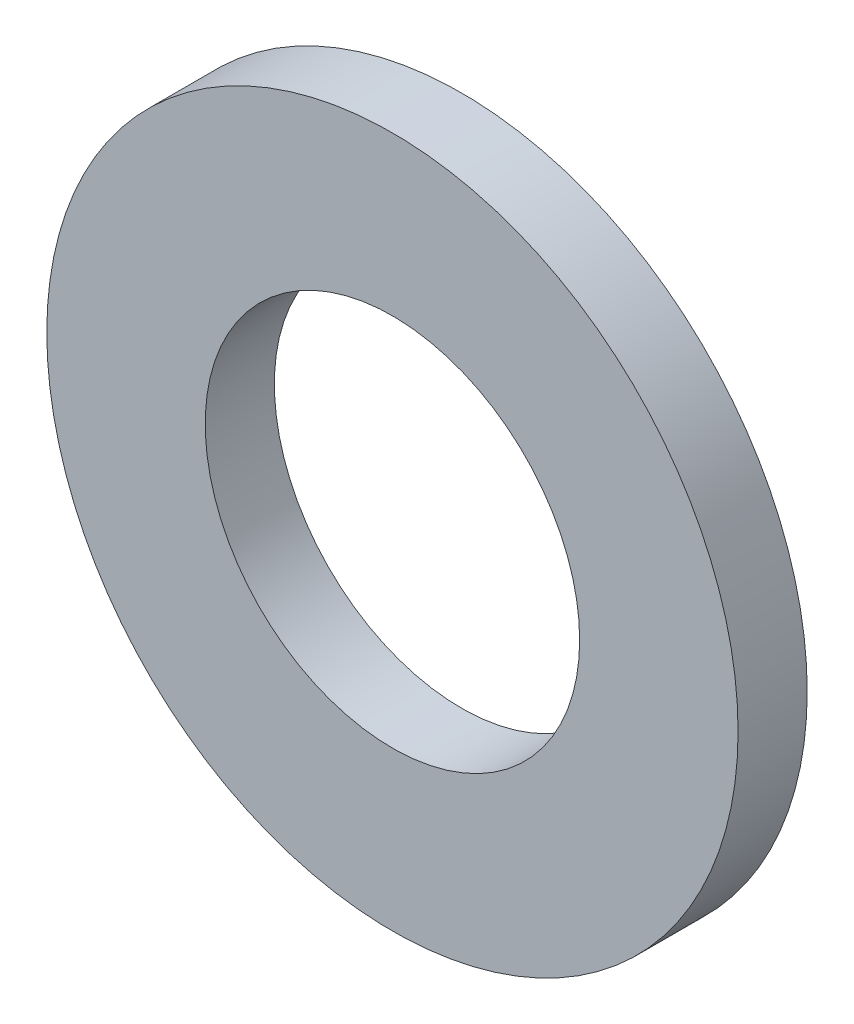
ISO-10303-21;
HEADER;
FILE_DESCRIPTION(('STEP AP214'),'2;1');
FILE_NAME('part.step','',(''),(''),'','','');
FILE_SCHEMA(('AUTOMOTIVE_DESIGN { 1 0 10303 214 1 1 1 1 }'));
ENDSEC;
DATA;
#1=APPLICATION_CONTEXT('core data for automotive mechanical design processes');
#2=APPLICATION_PROTOCOL_DEFINITION('international standard','automotive_design',2000,#1);
#3=PRODUCT_CONTEXT('',#1,'mechanical');
#4=PRODUCT('Part','Part','',(#3));
#5=PRODUCT_RELATED_PRODUCT_CATEGORY('part','',(#4));
#6=PRODUCT_DEFINITION_FORMATION('','',#4);
#7=PRODUCT_DEFINITION_CONTEXT('part definition',#1,'design');
#8=PRODUCT_DEFINITION('design','',#6,#7);
#9=PRODUCT_DEFINITION_SHAPE('','',#8);
#10=(LENGTH_UNIT() NAMED_UNIT(*) SI_UNIT(.MILLI.,.METRE.));
#11=(NAMED_UNIT(*) PLANE_ANGLE_UNIT() SI_UNIT($,.RADIAN.));
#12=(NAMED_UNIT(*) SI_UNIT($,.STERADIAN.) SOLID_ANGLE_UNIT());
#13=UNCERTAINTY_MEASURE_WITH_UNIT(LENGTH_MEASURE(1.E-05),#10,'distance_accuracy_value','');
#14=(GEOMETRIC_REPRESENTATION_CONTEXT(3) GLOBAL_UNCERTAINTY_ASSIGNED_CONTEXT((#13)) GLOBAL_UNIT_ASSIGNED_CONTEXT((#10,
#11,#12)) REPRESENTATION_CONTEXT('',''));
#15=CARTESIAN_POINT('',(0.,0.,0.));
#16=DIRECTION('',(0.,0.,1.));
#17=DIRECTION('',(1.,0.,0.));
#18=AXIS2_PLACEMENT_3D('',#15,#16,#17);
#19=CARTESIAN_POINT('',(0.,0.,1.2));
#20=DIRECTION('',(0.,0.,1.));
#21=DIRECTION('',(1.,0.,0.));
#22=AXIS2_PLACEMENT_3D('',#19,#20,#21);
#23=PLANE('',#22);
#24=CARTESIAN_POINT('',(0.,0.,1.2));
#25=DIRECTION('',(0.,0.,1.));
#26=DIRECTION('',(1.,0.,0.));
#27=AXIS2_PLACEMENT_3D('',#24,#25,#26);
#28=CIRCLE('',#27,6.);
#29=CARTESIAN_POINT('',(6.00000000000001,0.,1.2));
#30=VERTEX_POINT('',#29);
#31=EDGE_CURVE('E10',#30,#30,#28,.T.);
#32=ORIENTED_EDGE('',*,*,#31,.T.);
#33=EDGE_LOOP('',(#32));
#34=FACE_BOUND('',#33,.T.);
#35=CARTESIAN_POINT('',(0.,0.,1.2));
#36=DIRECTION('',(0.,0.,1.));
#37=DIRECTION('',(1.,0.,0.));
#38=AXIS2_PLACEMENT_3D('',#35,#36,#37);
#39=CIRCLE('',#38,3.25);
#40=CARTESIAN_POINT('',(3.25,0.,1.2));
#41=VERTEX_POINT('',#40);
#42=EDGE_CURVE('E35',#41,#41,#39,.T.);
#43=ORIENTED_EDGE('',*,*,#42,.F.);
#44=EDGE_LOOP('',(#43));
#45=FACE_BOUND('',#44,.T.);
#46=ADVANCED_FACE('F24',(#34,#45),#23,.T.);
#47=CARTESIAN_POINT('',(0.,0.,0.));
#48=DIRECTION('',(0.,0.,1.));
#49=DIRECTION('',(1.,0.,0.));
#50=AXIS2_PLACEMENT_3D('',#47,#48,#49);
#51=PLANE('',#50);
#52=CARTESIAN_POINT('',(0.,0.,0.));
#53=DIRECTION('',(0.,0.,1.));
#54=DIRECTION('',(1.,0.,0.));
#55=AXIS2_PLACEMENT_3D('',#52,#53,#54);
#56=CIRCLE('',#55,6.);
#57=CARTESIAN_POINT('',(6.00000000000001,0.,0.));
#58=VERTEX_POINT('',#57);
#59=EDGE_CURVE('E31',#58,#58,#56,.T.);
#60=ORIENTED_EDGE('',*,*,#59,.F.);
#61=EDGE_LOOP('',(#60));
#62=FACE_BOUND('',#61,.T.);
#63=CARTESIAN_POINT('',(0.,0.,0.));
#64=DIRECTION('',(0.,0.,1.));
#65=DIRECTION('',(1.,0.,0.));
#66=AXIS2_PLACEMENT_3D('',#63,#64,#65);
#67=CIRCLE('',#66,3.25);
#68=CARTESIAN_POINT('',(3.25,0.,0.));
#69=VERTEX_POINT('',#68);
#70=EDGE_CURVE('E39',#69,#69,#67,.T.);
#71=ORIENTED_EDGE('',*,*,#70,.T.);
#72=EDGE_LOOP('',(#71));
#73=FACE_BOUND('',#72,.T.);
#74=ADVANCED_FACE('F45',(#62,#73),#51,.F.);
#75=CARTESIAN_POINT('',(0.,0.,1.2));
#76=DIRECTION('',(0.,0.,-1.));
#77=DIRECTION('',(-1.,0.,0.));
#78=AXIS2_PLACEMENT_3D('',#75,#76,#77);
#79=CYLINDRICAL_SURFACE('',#78,6.);
#80=ORIENTED_EDGE('',*,*,#31,.F.);
#81=EDGE_LOOP('',(#80));
#82=FACE_BOUND('',#81,.T.);
#83=ORIENTED_EDGE('',*,*,#59,.T.);
#84=EDGE_LOOP('',(#83));
#85=FACE_BOUND('',#84,.T.);
#86=ADVANCED_FACE('F26',(#82,#85),#79,.T.);
#87=CARTESIAN_POINT('',(0.,0.,1.2));
#88=DIRECTION('',(0.,0.,-1.));
#89=DIRECTION('',(-1.,0.,0.));
#90=AXIS2_PLACEMENT_3D('',#87,#88,#89);
#91=CYLINDRICAL_SURFACE('',#90,3.25);
#92=ORIENTED_EDGE('',*,*,#42,.T.);
#93=EDGE_LOOP('',(#92));
#94=FACE_BOUND('',#93,.T.);
#95=ORIENTED_EDGE('',*,*,#70,.F.);
#96=EDGE_LOOP('',(#95));
#97=FACE_BOUND('',#96,.T.);
#98=ADVANCED_FACE('F47',(#94,#97),#91,.F.);
#99=CLOSED_SHELL('',(#46,#74,#86,#98));
#100=MANIFOLD_SOLID_BREP('B2',#99);
#101=ADVANCED_BREP_SHAPE_REPRESENTATION('',(#18,#100),#14);
#102=SHAPE_DEFINITION_REPRESENTATION(#9,#101);
ENDSEC;
END-ISO-10303-21;
